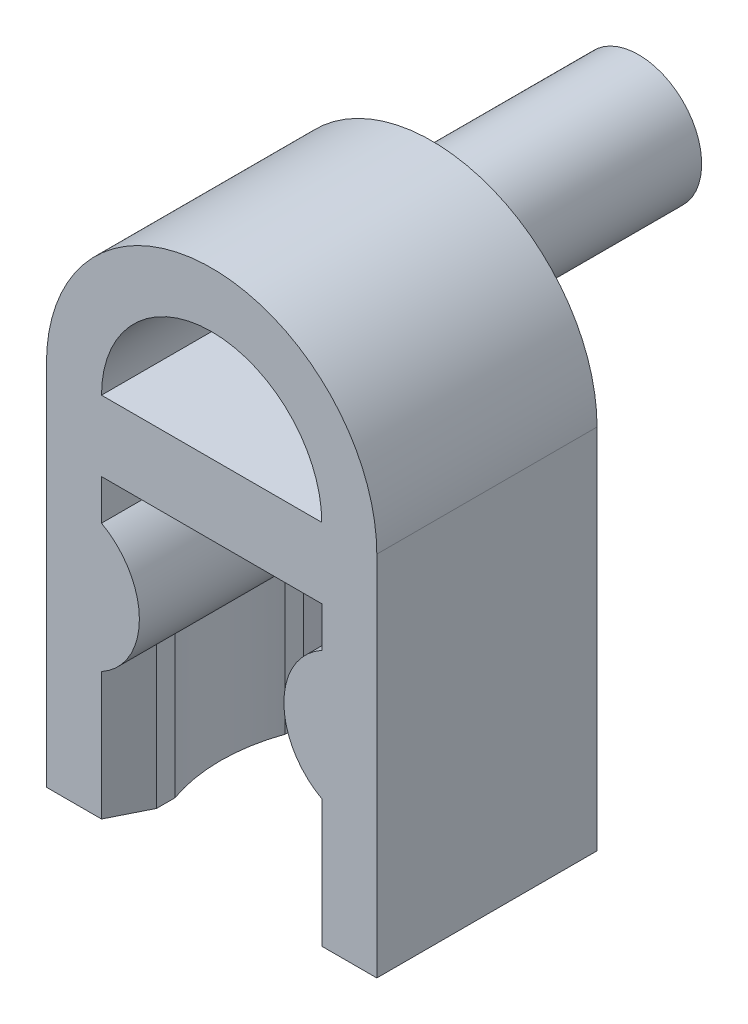
ISO-10303-21;
HEADER;
FILE_DESCRIPTION(('STEP AP214'),'2;1');
FILE_NAME('part.step','',(''),(''),'','','');
FILE_SCHEMA(('AUTOMOTIVE_DESIGN { 1 0 10303 214 1 1 1 1 }'));
ENDSEC;
DATA;
#1=APPLICATION_CONTEXT('core data for automotive mechanical design processes');
#2=APPLICATION_PROTOCOL_DEFINITION('international standard','automotive_design',2000,#1);
#3=PRODUCT_CONTEXT('',#1,'mechanical');
#4=PRODUCT('Part','Part','',(#3));
#5=PRODUCT_RELATED_PRODUCT_CATEGORY('part','',(#4));
#6=PRODUCT_DEFINITION_FORMATION('','',#4);
#7=PRODUCT_DEFINITION_CONTEXT('part definition',#1,'design');
#8=PRODUCT_DEFINITION('design','',#6,#7);
#9=PRODUCT_DEFINITION_SHAPE('','',#8);
#10=(LENGTH_UNIT() NAMED_UNIT(*) SI_UNIT(.MILLI.,.METRE.));
#11=(NAMED_UNIT(*) PLANE_ANGLE_UNIT() SI_UNIT($,.RADIAN.));
#12=(NAMED_UNIT(*) SI_UNIT($,.STERADIAN.) SOLID_ANGLE_UNIT());
#13=UNCERTAINTY_MEASURE_WITH_UNIT(LENGTH_MEASURE(1.E-05),#10,'distance_accuracy_value','');
#14=(GEOMETRIC_REPRESENTATION_CONTEXT(3) GLOBAL_UNCERTAINTY_ASSIGNED_CONTEXT((#13)) GLOBAL_UNIT_ASSIGNED_CONTEXT((#10,
#11,#12)) REPRESENTATION_CONTEXT('',''));
#15=CARTESIAN_POINT('',(0.,0.,0.));
#16=DIRECTION('',(0.,0.,1.));
#17=DIRECTION('',(1.,0.,0.));
#18=AXIS2_PLACEMENT_3D('',#15,#16,#17);
#19=CARTESIAN_POINT('',(-3.96824583655185,-4.77,6.));
#20=DIRECTION('',(0.,0.,-1.));
#21=DIRECTION('',(-1.,0.,0.));
#22=AXIS2_PLACEMENT_3D('',#19,#20,#21);
#23=CYLINDRICAL_SURFACE('',#22,2.);
#24=DIRECTION('',(0.,0.,-1.));
#25=VECTOR('',#24,1.);
#26=CARTESIAN_POINT('',(-2.5,-6.12803319674011,6.));
#27=LINE('',#26,#25);
#28=CARTESIAN_POINT('',(-2.5,-6.12803319674011,1.));
#29=VERTEX_POINT('',#28);
#30=CARTESIAN_POINT('',(-2.5,-6.12803319674011,1.5));
#31=VERTEX_POINT('',#30);
#32=EDGE_CURVE('E199',#29,#31,#27,.F.);
#33=ORIENTED_EDGE('',*,*,#32,.F.);
#34=CARTESIAN_POINT('',(-3.96824583655185,-4.77,-1.93649167310371));
#35=DIRECTION('',(0.894427190999916,0.,-0.447213595499958));
#36=DIRECTION('',(-0.447213595499958,0.,-0.894427190999916));
#37=AXIS2_PLACEMENT_3D('',#34,#35,#36);
#38=ELLIPSE('',#37,4.47213595499958,2.);
#39=CARTESIAN_POINT('',(-3.,-6.51999999968211,0.));
#40=VERTEX_POINT('',#39);
#41=EDGE_CURVE('E197',#40,#29,#38,.F.);
#42=ORIENTED_EDGE('',*,*,#41,.F.);
#43=CARTESIAN_POINT('',(-3.96824583655185,-4.77,0.));
#44=DIRECTION('',(0.,0.,1.));
#45=DIRECTION('',(-1.,0.,0.));
#46=AXIS2_PLACEMENT_3D('',#43,#44,#45);
#47=CIRCLE('',#46,2.);
#48=CARTESIAN_POINT('',(-3.,-3.02,0.));
#49=VERTEX_POINT('',#48);
#50=EDGE_CURVE('E184',#40,#49,#47,.T.);
#51=ORIENTED_EDGE('',*,*,#50,.T.);
#52=DIRECTION('',(0.,0.,-1.));
#53=VECTOR('',#52,1.);
#54=CARTESIAN_POINT('',(-3.,-3.02,6.));
#55=LINE('',#54,#53);
#56=CARTESIAN_POINT('',(-3.,-3.02,6.));
#57=VERTEX_POINT('',#56);
#58=EDGE_CURVE('E11',#57,#49,#55,.T.);
#59=ORIENTED_EDGE('',*,*,#58,.F.);
#60=CARTESIAN_POINT('',(-3.96824583655185,-4.77,6.));
#61=DIRECTION('',(0.,0.,1.));
#62=DIRECTION('',(-1.,0.,0.));
#63=AXIS2_PLACEMENT_3D('',#60,#61,#62);
#64=CIRCLE('',#63,2.);
#65=CARTESIAN_POINT('',(-3.,-6.52,6.));
#66=VERTEX_POINT('',#65);
#67=EDGE_CURVE('E207',#66,#57,#64,.T.);
#68=ORIENTED_EDGE('',*,*,#67,.F.);
#69=CARTESIAN_POINT('',(-3.96824583655185,-4.77,7.93649167310371));
#70=DIRECTION('',(0.894427190999916,0.,0.447213595499958));
#71=DIRECTION('',(0.447213595499958,0.,-0.894427190999916));
#72=AXIS2_PLACEMENT_3D('',#69,#70,#71);
#73=ELLIPSE('',#72,4.47213595499958,2.);
#74=CARTESIAN_POINT('',(-2.5,-6.12803319674011,5.));
#75=VERTEX_POINT('',#74);
#76=EDGE_CURVE('E51',#75,#66,#73,.F.);
#77=ORIENTED_EDGE('',*,*,#76,.F.);
#78=DIRECTION('',(0.,0.,-1.));
#79=VECTOR('',#78,1.);
#80=CARTESIAN_POINT('',(-2.5,-6.12803319674011,6.));
#81=LINE('',#80,#79);
#82=CARTESIAN_POINT('',(-2.5,-6.12803319674782,4.5));
#83=VERTEX_POINT('',#82);
#84=EDGE_CURVE('E55',#83,#75,#81,.F.);
#85=ORIENTED_EDGE('',*,*,#84,.F.);
#86=CARTESIAN_POINT('',(-2.5,-6.12803319674782,1.5));
#87=CARTESIAN_POINT('',(-2.51335384380951,-6.14246691343955,1.53776626442588));
#88=CARTESIAN_POINT('',(-2.52630020378791,-6.15604120585051,1.57599334475921));
#89=CARTESIAN_POINT('',(-2.55129940671943,-6.18158925104955,1.65325418658924));
#90=CARTESIAN_POINT('',(-2.56335248885841,-6.19356343298108,1.69228772854033));
#91=CARTESIAN_POINT('',(-2.59803115870179,-6.22724167132125,1.81034298620861));
#92=CARTESIAN_POINT('',(-2.6192150939947,-6.24674231980654,1.89042880993735));
#93=CARTESIAN_POINT('',(-2.65727731080432,-6.28063176077419,2.05255387403511));
#94=CARTESIAN_POINT('',(-2.67416024643319,-6.2950260854897,2.13459089696433));
#95=CARTESIAN_POINT('',(-2.70339948309578,-6.31936284719166,2.30014632286391));
#96=CARTESIAN_POINT('',(-2.71575407638802,-6.32930360494964,2.38366527227965));
#97=CARTESIAN_POINT('',(-2.73585364732032,-6.34523811040913,2.55237334444175));
#98=CARTESIAN_POINT('',(-2.74355723558507,-6.35119646731376,2.63757069146816));
#99=CARTESIAN_POINT('',(-2.75409729877905,-6.35930403115432,2.80847762889126));
#100=CARTESIAN_POINT('',(-2.75693185554734,-6.3614517368905,2.89418740782425));
#101=CARTESIAN_POINT('',(-2.75769716661006,-6.36203397847896,3.06565220206671));
#102=CARTESIAN_POINT('',(-2.7556273088424,-6.36046805087649,3.15140722168685));
#103=CARTESIAN_POINT('',(-2.74660684798277,-6.35354996179177,3.32247523197276));
#104=CARTESIAN_POINT('',(-2.73965810785353,-6.34819924549542,3.40778837884228));
#105=CARTESIAN_POINT('',(-2.72067871598569,-6.33324267694126,3.58009902817843));
#106=CARTESIAN_POINT('',(-2.7085013826975,-6.32351358307846,3.66706992657042));
#107=CARTESIAN_POINT('',(-2.67922701903464,-6.29931073700253,3.839481604955));
#108=CARTESIAN_POINT('',(-2.66213182985103,-6.2848387601907,3.92492294490436));
#109=CARTESIAN_POINT('',(-2.62327351056184,-6.25044774732333,4.09375348902662));
#110=CARTESIAN_POINT('',(-2.60150539083328,-6.23052288252821,4.17714039259491));
#111=CARTESIAN_POINT('',(-2.56570074808495,-6.19588264236902,4.30000817257131));
#112=CARTESIAN_POINT('',(-2.55322978909883,-6.18353255335001,4.34062532870437));
#113=CARTESIAN_POINT('',(-2.52731963696502,-6.1571091374482,4.4209942509042));
#114=CARTESIAN_POINT('',(-2.51388015900862,-6.14303530281192,4.46074575790099));
#115=CARTESIAN_POINT('',(-2.50000000000022,-6.12803319674034,4.49999999999938));
#116=B_SPLINE_CURVE_WITH_KNOTS('',3,(#86,#87,#88,#89,#90,#91,#92,#93,#94,#95,#96,#97,#98,#99,
#100,#101,#102,#103,#104,#105,#106,#107,#108,#109,#110,#111,#112,#113,#114,#115),.UNSPECIFIED.,
.F.,.F.,(4,2,2,2,2,2,2,2,2,2,2,2,2,2,4),(0.,0.127705392100496,0.255376465070504,
0.510350470775594,0.765047385774155,1.01984025421878,1.27686833283261,1.53399764477134,
1.79115904767463,2.04822230889017,2.31302381578273,2.57772631264491,2.84271286984063,
2.97540777210756,3.10814185595436),.UNSPECIFIED.);
#117=EDGE_CURVE('E475',#31,#83,#116,.T.);
#118=ORIENTED_EDGE('',*,*,#117,.F.);
#119=EDGE_LOOP('',(#33,#42,#51,#59,#68,#77,#85,#118));
#120=FACE_BOUND('',#119,.T.);
#121=ADVANCED_FACE('F37',(#120),#23,.T.);
#122=CARTESIAN_POINT('',(-3.,-3.02,6.));
#123=DIRECTION('',(-1.,0.,0.));
#124=DIRECTION('',(0.,0.,1.));
#125=AXIS2_PLACEMENT_3D('',#122,#123,#124);
#126=PLANE('',#125);
#127=DIRECTION('',(0.,1.,0.));
#128=VECTOR('',#127,1.);
#129=CARTESIAN_POINT('',(-3.,-3.02,0.));
#130=LINE('',#129,#128);
#131=CARTESIAN_POINT('',(-3.,-1.92,0.));
#132=VERTEX_POINT('',#131);
#133=EDGE_CURVE('E192',#49,#132,#130,.T.);
#134=ORIENTED_EDGE('',*,*,#133,.T.);
#135=DIRECTION('',(0.,0.,-1.));
#136=VECTOR('',#135,1.);
#137=CARTESIAN_POINT('',(-3.,-1.92,6.));
#138=LINE('',#137,#136);
#139=CARTESIAN_POINT('',(-3.,-1.92,6.));
#140=VERTEX_POINT('',#139);
#141=EDGE_CURVE('E44',#140,#132,#138,.T.);
#142=ORIENTED_EDGE('',*,*,#141,.F.);
#143=DIRECTION('',(0.,1.,0.));
#144=VECTOR('',#143,1.);
#145=CARTESIAN_POINT('',(-3.,-3.02,6.));
#146=LINE('',#145,#144);
#147=EDGE_CURVE('E211',#57,#140,#146,.T.);
#148=ORIENTED_EDGE('',*,*,#147,.F.);
#149=ORIENTED_EDGE('',*,*,#58,.T.);
#150=EDGE_LOOP('',(#134,#142,#148,#149));
#151=FACE_BOUND('',#150,.T.);
#152=ADVANCED_FACE('F384',(#151),#126,.F.);
#153=CARTESIAN_POINT('',(-3.,-1.92,6.));
#154=DIRECTION('',(0.,1.,0.));
#155=DIRECTION('',(0.,0.,1.));
#156=AXIS2_PLACEMENT_3D('',#153,#154,#155);
#157=PLANE('',#156);
#158=DIRECTION('',(1.,0.,0.));
#159=VECTOR('',#158,1.);
#160=CARTESIAN_POINT('',(-3.,-1.92,0.));
#161=LINE('',#160,#159);
#162=CARTESIAN_POINT('',(3.,-1.92,0.));
#163=VERTEX_POINT('',#162);
#164=EDGE_CURVE('E241',#132,#163,#161,.T.);
#165=ORIENTED_EDGE('',*,*,#164,.T.);
#166=DIRECTION('',(0.,0.,-1.));
#167=VECTOR('',#166,1.);
#168=CARTESIAN_POINT('',(3.,-1.92,6.));
#169=LINE('',#168,#167);
#170=CARTESIAN_POINT('',(3.,-1.92,6.));
#171=VERTEX_POINT('',#170);
#172=EDGE_CURVE('E233',#171,#163,#169,.T.);
#173=ORIENTED_EDGE('',*,*,#172,.F.);
#174=DIRECTION('',(1.,0.,0.));
#175=VECTOR('',#174,1.);
#176=CARTESIAN_POINT('',(-3.,-1.92,6.));
#177=LINE('',#176,#175);
#178=EDGE_CURVE('E242',#140,#171,#177,.T.);
#179=ORIENTED_EDGE('',*,*,#178,.F.);
#180=ORIENTED_EDGE('',*,*,#141,.T.);
#181=EDGE_LOOP('',(#165,#173,#179,#180));
#182=FACE_BOUND('',#181,.T.);
#183=ADVANCED_FACE('F239',(#182),#157,.F.);
#184=CARTESIAN_POINT('',(3.,-1.92,6.));
#185=DIRECTION('',(1.,0.,0.));
#186=DIRECTION('',(0.,0.,-1.));
#187=AXIS2_PLACEMENT_3D('',#184,#185,#186);
#188=PLANE('',#187);
#189=DIRECTION('',(0.,-1.,0.));
#190=VECTOR('',#189,1.);
#191=CARTESIAN_POINT('',(3.,-1.92,0.));
#192=LINE('',#191,#190);
#193=CARTESIAN_POINT('',(3.,-3.02,0.));
#194=VERTEX_POINT('',#193);
#195=EDGE_CURVE('E246',#163,#194,#192,.T.);
#196=ORIENTED_EDGE('',*,*,#195,.T.);
#197=DIRECTION('',(0.,0.,-1.));
#198=VECTOR('',#197,1.);
#199=CARTESIAN_POINT('',(3.,-3.02,6.));
#200=LINE('',#199,#198);
#201=CARTESIAN_POINT('',(3.,-3.02,6.));
#202=VERTEX_POINT('',#201);
#203=EDGE_CURVE('E230',#202,#194,#200,.T.);
#204=ORIENTED_EDGE('',*,*,#203,.F.);
#205=DIRECTION('',(0.,-1.,0.));
#206=VECTOR('',#205,1.);
#207=CARTESIAN_POINT('',(3.,-1.92,6.));
#208=LINE('',#207,#206);
#209=EDGE_CURVE('E294',#171,#202,#208,.T.);
#210=ORIENTED_EDGE('',*,*,#209,.F.);
#211=ORIENTED_EDGE('',*,*,#172,.T.);
#212=EDGE_LOOP('',(#196,#204,#210,#211));
#213=FACE_BOUND('',#212,.T.);
#214=ADVANCED_FACE('F391',(#213),#188,.F.);
#215=CARTESIAN_POINT('',(3.96824583655186,-4.77,6.));
#216=DIRECTION('',(0.,0.,-1.));
#217=DIRECTION('',(-1.,0.,0.));
#218=AXIS2_PLACEMENT_3D('',#215,#216,#217);
#219=CYLINDRICAL_SURFACE('',#218,2.);
#220=CARTESIAN_POINT('',(3.96824583655186,-4.77,0.));
#221=DIRECTION('',(0.,0.,1.));
#222=DIRECTION('',(1.,0.,0.));
#223=AXIS2_PLACEMENT_3D('',#220,#221,#222);
#224=CIRCLE('',#223,2.);
#225=CARTESIAN_POINT('',(3.,-6.52,0.));
#226=VERTEX_POINT('',#225);
#227=EDGE_CURVE('E248',#194,#226,#224,.T.);
#228=ORIENTED_EDGE('',*,*,#227,.T.);
#229=CARTESIAN_POINT('',(3.96824583655186,-4.77,-1.93649167310371));
#230=DIRECTION('',(-0.894427190999916,0.,-0.447213595499958));
#231=DIRECTION('',(0.447213595499958,0.,-0.894427190999916));
#232=AXIS2_PLACEMENT_3D('',#229,#230,#231);
#233=ELLIPSE('',#232,4.47213595499958,2.);
#234=CARTESIAN_POINT('',(2.5,-6.1280331967401,0.999999999999999));
#235=VERTEX_POINT('',#234);
#236=EDGE_CURVE('E325',#235,#226,#233,.F.);
#237=ORIENTED_EDGE('',*,*,#236,.F.);
#238=DIRECTION('',(0.,0.,-1.));
#239=VECTOR('',#238,1.);
#240=CARTESIAN_POINT('',(2.5,-6.1280331967401,6.));
#241=LINE('',#240,#239);
#242=CARTESIAN_POINT('',(2.5,-6.12803319674781,1.5));
#243=VERTEX_POINT('',#242);
#244=EDGE_CURVE('E329',#243,#235,#241,.T.);
#245=ORIENTED_EDGE('',*,*,#244,.F.);
#246=CARTESIAN_POINT('',(2.5,-6.12803319674781,4.5));
#247=CARTESIAN_POINT('',(2.51335384380951,-6.14246691343954,4.46223373557412));
#248=CARTESIAN_POINT('',(2.52630020378791,-6.15604120585051,4.42400665524079));
#249=CARTESIAN_POINT('',(2.55129940671943,-6.18158925104955,4.34674581341076));
#250=CARTESIAN_POINT('',(2.56335248885841,-6.19356343298108,4.30771227145967));
#251=CARTESIAN_POINT('',(2.59803115870179,-6.22724167132125,4.18965701379139));
#252=CARTESIAN_POINT('',(2.6192150939947,-6.24674231980654,4.10957119006265));
#253=CARTESIAN_POINT('',(2.65727731080432,-6.28063176077419,3.94744612596489));
#254=CARTESIAN_POINT('',(2.67416024643319,-6.2950260854897,3.86540910303566));
#255=CARTESIAN_POINT('',(2.70339948309578,-6.31936284719166,3.69985367713609));
#256=CARTESIAN_POINT('',(2.71575407638802,-6.32930360494964,3.61633472772035));
#257=CARTESIAN_POINT('',(2.73585364732032,-6.34523811040913,3.44762665555825));
#258=CARTESIAN_POINT('',(2.74355723558507,-6.35119646731376,3.36242930853184));
#259=CARTESIAN_POINT('',(2.75409729877905,-6.35930403115432,3.19152237110874));
#260=CARTESIAN_POINT('',(2.75693185554734,-6.3614517368905,3.10581259217575));
#261=CARTESIAN_POINT('',(2.75769716661006,-6.36203397847896,2.93434779793329));
#262=CARTESIAN_POINT('',(2.7556273088424,-6.36046805087649,2.84859277831315));
#263=CARTESIAN_POINT('',(2.74660684798277,-6.35354996179176,2.67752476802724));
#264=CARTESIAN_POINT('',(2.73965810785353,-6.34819924549542,2.59221162115772));
#265=CARTESIAN_POINT('',(2.72067871598569,-6.33324267694126,2.41990097182157));
#266=CARTESIAN_POINT('',(2.7085013826975,-6.32351358307846,2.33293007342958));
#267=CARTESIAN_POINT('',(2.67922701903464,-6.29931073700253,2.160518395045));
#268=CARTESIAN_POINT('',(2.66213182985103,-6.2848387601907,2.07507705509564));
#269=CARTESIAN_POINT('',(2.62327351056184,-6.25044774732333,1.90624651097339));
#270=CARTESIAN_POINT('',(2.60150539083328,-6.23052288252821,1.82285960740509));
#271=CARTESIAN_POINT('',(2.56570074808495,-6.19588264236902,1.6999918274287));
#272=CARTESIAN_POINT('',(2.55322978909883,-6.18353255335001,1.65937467129564));
#273=CARTESIAN_POINT('',(2.52731963696502,-6.1571091374482,1.57900574909581));
#274=CARTESIAN_POINT('',(2.51388015900862,-6.14303530281192,1.53925424209901));
#275=CARTESIAN_POINT('',(2.50000000000022,-6.12803319674034,1.50000000000062));
#276=B_SPLINE_CURVE_WITH_KNOTS('',3,(#246,#247,#248,#249,#250,#251,#252,#253,#254,#255,#256,
#257,#258,#259,#260,#261,#262,#263,#264,#265,#266,#267,#268,#269,#270,#271,#272,#273,#274,#275),
.UNSPECIFIED.,.F.,.F.,(4,2,2,2,2,2,2,2,2,2,2,2,2,2,4),(0.,0.127705392100496,0.255376465070504,
0.510350470775595,0.765047385774156,1.01984025421878,1.27686833283261,1.53399764477134,
1.79115904767463,2.04822230889017,2.31302381578273,2.57772631264491,2.84271286984063,
2.97540777210755,3.10814185595436),.UNSPECIFIED.);
#277=CARTESIAN_POINT('',(2.5,-6.1280331967401,4.5));
#278=VERTEX_POINT('',#277);
#279=EDGE_CURVE('E353',#278,#243,#276,.T.);
#280=ORIENTED_EDGE('',*,*,#279,.F.);
#281=DIRECTION('',(0.,0.,-1.));
#282=VECTOR('',#281,1.);
#283=CARTESIAN_POINT('',(2.5,-6.1280331967401,6.));
#284=LINE('',#283,#282);
#285=CARTESIAN_POINT('',(2.499999999976,-6.12803319671416,4.99999999995199));
#286=VERTEX_POINT('',#285);
#287=EDGE_CURVE('E323',#286,#278,#284,.T.);
#288=ORIENTED_EDGE('',*,*,#287,.F.);
#289=CARTESIAN_POINT('',(3.96824583655186,-4.77,7.93649167310371));
#290=DIRECTION('',(-0.894427190999916,0.,0.447213595499958));
#291=DIRECTION('',(-0.447213595499958,0.,-0.894427190999916));
#292=AXIS2_PLACEMENT_3D('',#289,#290,#291);
#293=ELLIPSE('',#292,4.47213595499958,2.);
#294=CARTESIAN_POINT('',(3.,-6.52,6.));
#295=VERTEX_POINT('',#294);
#296=EDGE_CURVE('E320',#295,#286,#293,.F.);
#297=ORIENTED_EDGE('',*,*,#296,.F.);
#298=CARTESIAN_POINT('',(3.96824583655186,-4.77,6.));
#299=DIRECTION('',(0.,0.,1.));
#300=DIRECTION('',(1.,0.,0.));
#301=AXIS2_PLACEMENT_3D('',#298,#299,#300);
#302=CIRCLE('',#301,2.);
#303=EDGE_CURVE('E291',#202,#295,#302,.T.);
#304=ORIENTED_EDGE('',*,*,#303,.F.);
#305=ORIENTED_EDGE('',*,*,#203,.T.);
#306=EDGE_LOOP('',(#228,#237,#245,#280,#288,#297,#304,#305));
#307=FACE_BOUND('',#306,.T.);
#308=ADVANCED_FACE('F396',(#307),#219,.T.);
#309=CARTESIAN_POINT('',(4.5,-10.,6.));
#310=DIRECTION('',(0.,1.,0.));
#311=DIRECTION('',(-1.,0.,0.));
#312=AXIS2_PLACEMENT_3D('',#309,#310,#311);
#313=PLANE('',#312);
#314=DIRECTION('',(1.,0.,0.));
#315=VECTOR('',#314,1.);
#316=CARTESIAN_POINT('',(4.5,-10.,0.));
#317=LINE('',#316,#315);
#318=CARTESIAN_POINT('',(3.,-10.,0.));
#319=VERTEX_POINT('',#318);
#320=CARTESIAN_POINT('',(4.5,-10.,0.));
#321=VERTEX_POINT('',#320);
#322=EDGE_CURVE('E256',#319,#321,#317,.T.);
#323=ORIENTED_EDGE('',*,*,#322,.T.);
#324=DIRECTION('',(0.,0.,-1.));
#325=VECTOR('',#324,1.);
#326=CARTESIAN_POINT('',(4.5,-10.,6.));
#327=LINE('',#326,#325);
#328=CARTESIAN_POINT('',(4.5,-10.,6.));
#329=VERTEX_POINT('',#328);
#330=EDGE_CURVE('E227',#329,#321,#327,.T.);
#331=ORIENTED_EDGE('',*,*,#330,.F.);
#332=DIRECTION('',(1.,0.,0.));
#333=VECTOR('',#332,1.);
#334=CARTESIAN_POINT('',(4.5,-10.,6.));
#335=LINE('',#334,#333);
#336=CARTESIAN_POINT('',(3.,-10.,6.));
#337=VERTEX_POINT('',#336);
#338=EDGE_CURVE('E287',#337,#329,#335,.T.);
#339=ORIENTED_EDGE('',*,*,#338,.F.);
#340=DIRECTION('',(-0.447213595499958,0.,-0.894427190999916));
#341=VECTOR('',#340,1.);
#342=CARTESIAN_POINT('',(2.5,-10.,5.));
#343=LINE('',#342,#341);
#344=CARTESIAN_POINT('',(2.5,-10.,5.));
#345=VERTEX_POINT('',#344);
#346=EDGE_CURVE('E317',#337,#345,#343,.T.);
#347=ORIENTED_EDGE('',*,*,#346,.T.);
#348=DIRECTION('',(0.,0.,-1.));
#349=VECTOR('',#348,1.);
#350=CARTESIAN_POINT('',(2.5,-10.,5.));
#351=LINE('',#350,#349);
#352=CARTESIAN_POINT('',(2.5,-10.,4.5));
#353=VERTEX_POINT('',#352);
#354=EDGE_CURVE('E337',#345,#353,#351,.T.);
#355=ORIENTED_EDGE('',*,*,#354,.T.);
#356=CARTESIAN_POINT('',(-1.74264068711928,-10.,3.));
#357=DIRECTION('',(0.,1.,0.));
#358=DIRECTION('',(0.,0.,1.));
#359=AXIS2_PLACEMENT_3D('',#356,#357,#358);
#360=CIRCLE('',#359,4.5);
#361=CARTESIAN_POINT('',(2.5,-10.,1.5));
#362=VERTEX_POINT('',#361);
#363=EDGE_CURVE('E340',#353,#362,#360,.T.);
#364=ORIENTED_EDGE('',*,*,#363,.T.);
#365=DIRECTION('',(0.,0.,-1.));
#366=VECTOR('',#365,1.);
#367=CARTESIAN_POINT('',(2.5,-10.,0.999999999999999));
#368=LINE('',#367,#366);
#369=CARTESIAN_POINT('',(2.5,-10.,0.999999999999999));
#370=VERTEX_POINT('',#369);
#371=EDGE_CURVE('E343',#362,#370,#368,.T.);
#372=ORIENTED_EDGE('',*,*,#371,.T.);
#373=DIRECTION('',(0.447213595499958,0.,-0.894427190999916));
#374=VECTOR('',#373,1.);
#375=CARTESIAN_POINT('',(2.5,-10.,0.999999999999999));
#376=LINE('',#375,#374);
#377=EDGE_CURVE('E344',#370,#319,#376,.T.);
#378=ORIENTED_EDGE('',*,*,#377,.T.);
#379=EDGE_LOOP('',(#323,#331,#339,#347,#355,#364,#372,#378));
#380=FACE_BOUND('',#379,.T.);
#381=ADVANCED_FACE('F400',(#380),#313,.F.);
#382=CARTESIAN_POINT('',(4.5,0.,6.));
#383=DIRECTION('',(-1.,0.,0.));
#384=DIRECTION('',(0.,-1.,0.));
#385=AXIS2_PLACEMENT_3D('',#382,#383,#384);
#386=PLANE('',#385);
#387=DIRECTION('',(0.,1.,0.));
#388=VECTOR('',#387,1.);
#389=CARTESIAN_POINT('',(4.5,0.,0.));
#390=LINE('',#389,#388);
#391=CARTESIAN_POINT('',(4.5,0.,0.));
#392=VERTEX_POINT('',#391);
#393=EDGE_CURVE('E258',#321,#392,#390,.T.);
#394=ORIENTED_EDGE('',*,*,#393,.T.);
#395=DIRECTION('',(0.,0.,-1.));
#396=VECTOR('',#395,1.);
#397=CARTESIAN_POINT('',(4.5,0.,6.));
#398=LINE('',#397,#396);
#399=CARTESIAN_POINT('',(4.5,0.,6.));
#400=VERTEX_POINT('',#399);
#401=EDGE_CURVE('E224',#400,#392,#398,.T.);
#402=ORIENTED_EDGE('',*,*,#401,.F.);
#403=DIRECTION('',(0.,1.,0.));
#404=VECTOR('',#403,1.);
#405=CARTESIAN_POINT('',(4.5,0.,6.));
#406=LINE('',#405,#404);
#407=EDGE_CURVE('E285',#329,#400,#406,.T.);
#408=ORIENTED_EDGE('',*,*,#407,.F.);
#409=ORIENTED_EDGE('',*,*,#330,.T.);
#410=EDGE_LOOP('',(#394,#402,#408,#409));
#411=FACE_BOUND('',#410,.T.);
#412=ADVANCED_FACE('F404',(#411),#386,.F.);
#413=CARTESIAN_POINT('',(0.,0.,6.));
#414=DIRECTION('',(0.,0.,-1.));
#415=DIRECTION('',(-1.,0.,0.));
#416=AXIS2_PLACEMENT_3D('',#413,#414,#415);
#417=CYLINDRICAL_SURFACE('',#416,4.5);
#418=CARTESIAN_POINT('',(0.,0.,0.));
#419=DIRECTION('',(0.,0.,1.));
#420=DIRECTION('',(1.,0.,0.));
#421=AXIS2_PLACEMENT_3D('',#418,#419,#420);
#422=CIRCLE('',#421,4.5);
#423=CARTESIAN_POINT('',(-4.5,0.,0.));
#424=VERTEX_POINT('',#423);
#425=EDGE_CURVE('E260',#392,#424,#422,.T.);
#426=ORIENTED_EDGE('',*,*,#425,.T.);
#427=DIRECTION('',(0.,0.,-1.));
#428=VECTOR('',#427,1.);
#429=CARTESIAN_POINT('',(-4.5,0.,6.));
#430=LINE('',#429,#428);
#431=CARTESIAN_POINT('',(-4.5,0.,6.));
#432=VERTEX_POINT('',#431);
#433=EDGE_CURVE('E220',#432,#424,#430,.T.);
#434=ORIENTED_EDGE('',*,*,#433,.F.);
#435=CARTESIAN_POINT('',(0.,0.,6.));
#436=DIRECTION('',(0.,0.,1.));
#437=DIRECTION('',(1.,0.,0.));
#438=AXIS2_PLACEMENT_3D('',#435,#436,#437);
#439=CIRCLE('',#438,4.5);
#440=EDGE_CURVE('E281',#400,#432,#439,.T.);
#441=ORIENTED_EDGE('',*,*,#440,.F.);
#442=ORIENTED_EDGE('',*,*,#401,.T.);
#443=EDGE_LOOP('',(#426,#434,#441,#442));
#444=FACE_BOUND('',#443,.T.);
#445=ADVANCED_FACE('F408',(#444),#417,.T.);
#446=CARTESIAN_POINT('',(-4.5,0.,6.));
#447=DIRECTION('',(1.,0.,0.));
#448=DIRECTION('',(0.,1.,0.));
#449=AXIS2_PLACEMENT_3D('',#446,#447,#448);
#450=PLANE('',#449);
#451=DIRECTION('',(0.,-1.,0.));
#452=VECTOR('',#451,1.);
#453=CARTESIAN_POINT('',(-4.5,0.,0.));
#454=LINE('',#453,#452);
#455=CARTESIAN_POINT('',(-4.5,-10.,0.));
#456=VERTEX_POINT('',#455);
#457=EDGE_CURVE('E213',#424,#456,#454,.T.);
#458=ORIENTED_EDGE('',*,*,#457,.T.);
#459=DIRECTION('',(0.,0.,-1.));
#460=VECTOR('',#459,1.);
#461=CARTESIAN_POINT('',(-4.5,-10.,6.));
#462=LINE('',#461,#460);
#463=CARTESIAN_POINT('',(-4.5,-10.,6.));
#464=VERTEX_POINT('',#463);
#465=EDGE_CURVE('E217',#464,#456,#462,.T.);
#466=ORIENTED_EDGE('',*,*,#465,.F.);
#467=DIRECTION('',(0.,-1.,0.));
#468=VECTOR('',#467,1.);
#469=CARTESIAN_POINT('',(-4.5,0.,6.));
#470=LINE('',#469,#468);
#471=EDGE_CURVE('E278',#432,#464,#470,.T.);
#472=ORIENTED_EDGE('',*,*,#471,.F.);
#473=ORIENTED_EDGE('',*,*,#433,.T.);
#474=EDGE_LOOP('',(#458,#466,#472,#473));
#475=FACE_BOUND('',#474,.T.);
#476=ADVANCED_FACE('F264',(#475),#450,.F.);
#477=CARTESIAN_POINT('',(-4.5,-10.,6.));
#478=DIRECTION('',(0.,1.,0.));
#479=DIRECTION('',(0.,0.,1.));
#480=AXIS2_PLACEMENT_3D('',#477,#478,#479);
#481=PLANE('',#480);
#482=DIRECTION('',(1.,0.,0.));
#483=VECTOR('',#482,1.);
#484=CARTESIAN_POINT('',(-4.5,-10.,0.));
#485=LINE('',#484,#483);
#486=CARTESIAN_POINT('',(-3.,-10.,0.));
#487=VERTEX_POINT('',#486);
#488=EDGE_CURVE('E208',#456,#487,#485,.T.);
#489=ORIENTED_EDGE('',*,*,#488,.T.);
#490=DIRECTION('',(0.447213595499958,0.,0.894427190999916));
#491=VECTOR('',#490,1.);
#492=CARTESIAN_POINT('',(-2.5,-10.,1.));
#493=LINE('',#492,#491);
#494=CARTESIAN_POINT('',(-2.5,-10.,1.));
#495=VERTEX_POINT('',#494);
#496=EDGE_CURVE('E206',#487,#495,#493,.T.);
#497=ORIENTED_EDGE('',*,*,#496,.T.);
#498=DIRECTION('',(0.,0.,1.));
#499=VECTOR('',#498,1.);
#500=CARTESIAN_POINT('',(-2.5,-10.,1.));
#501=LINE('',#500,#499);
#502=CARTESIAN_POINT('',(-2.5,-10.,1.5));
#503=VERTEX_POINT('',#502);
#504=EDGE_CURVE('E324',#495,#503,#501,.T.);
#505=ORIENTED_EDGE('',*,*,#504,.T.);
#506=CARTESIAN_POINT('',(1.74264068711928,-10.,3.));
#507=DIRECTION('',(0.,1.,0.));
#508=DIRECTION('',(0.,0.,-1.));
#509=AXIS2_PLACEMENT_3D('',#506,#507,#508);
#510=CIRCLE('',#509,4.5);
#511=CARTESIAN_POINT('',(-2.5,-10.,4.5));
#512=VERTEX_POINT('',#511);
#513=EDGE_CURVE('E515',#503,#512,#510,.T.);
#514=ORIENTED_EDGE('',*,*,#513,.T.);
#515=DIRECTION('',(0.,0.,1.));
#516=VECTOR('',#515,1.);
#517=CARTESIAN_POINT('',(-2.5,-10.,5.));
#518=LINE('',#517,#516);
#519=CARTESIAN_POINT('',(-2.5,-10.,5.));
#520=VERTEX_POINT('',#519);
#521=EDGE_CURVE('E504',#512,#520,#518,.T.);
#522=ORIENTED_EDGE('',*,*,#521,.T.);
#523=DIRECTION('',(-0.447213595499958,0.,0.894427190999916));
#524=VECTOR('',#523,1.);
#525=CARTESIAN_POINT('',(-2.5,-10.,5.));
#526=LINE('',#525,#524);
#527=CARTESIAN_POINT('',(-3.,-10.,6.));
#528=VERTEX_POINT('',#527);
#529=EDGE_CURVE('E275',#520,#528,#526,.T.);
#530=ORIENTED_EDGE('',*,*,#529,.T.);
#531=DIRECTION('',(1.,0.,0.));
#532=VECTOR('',#531,1.);
#533=CARTESIAN_POINT('',(-4.5,-10.,6.));
#534=LINE('',#533,#532);
#535=EDGE_CURVE('E272',#464,#528,#534,.T.);
#536=ORIENTED_EDGE('',*,*,#535,.F.);
#537=ORIENTED_EDGE('',*,*,#465,.T.);
#538=EDGE_LOOP('',(#489,#497,#505,#514,#522,#530,#536,#537));
#539=FACE_BOUND('',#538,.T.);
#540=ADVANCED_FACE('F270',(#539),#481,.F.);
#541=CARTESIAN_POINT('',(-3.96824583655185,-4.77,6.));
#542=DIRECTION('',(0.,0.,-1.));
#543=DIRECTION('',(-1.,0.,0.));
#544=AXIS2_PLACEMENT_3D('',#541,#542,#543);
#545=PLANE('',#544);
#546=DIRECTION('',(1.,0.,0.));
#547=VECTOR('',#546,1.);
#548=CARTESIAN_POINT('',(3.,0.,6.));
#549=LINE('',#548,#547);
#550=CARTESIAN_POINT('',(-3.,0.,6.));
#551=VERTEX_POINT('',#550);
#552=CARTESIAN_POINT('',(3.,0.,6.));
#553=VERTEX_POINT('',#552);
#554=EDGE_CURVE('E303',#551,#553,#549,.T.);
#555=ORIENTED_EDGE('',*,*,#554,.F.);
#556=CARTESIAN_POINT('',(0.,0.,6.));
#557=DIRECTION('',(0.,0.,1.));
#558=DIRECTION('',(1.,0.,0.));
#559=AXIS2_PLACEMENT_3D('',#556,#557,#558);
#560=CIRCLE('',#559,3.);
#561=EDGE_CURVE('E307',#553,#551,#560,.T.);
#562=ORIENTED_EDGE('',*,*,#561,.F.);
#563=EDGE_LOOP('',(#555,#562));
#564=FACE_BOUND('',#563,.T.);
#565=ORIENTED_EDGE('',*,*,#67,.T.);
#566=ORIENTED_EDGE('',*,*,#147,.T.);
#567=ORIENTED_EDGE('',*,*,#178,.T.);
#568=ORIENTED_EDGE('',*,*,#209,.T.);
#569=ORIENTED_EDGE('',*,*,#303,.T.);
#570=DIRECTION('',(0.,-1.,0.));
#571=VECTOR('',#570,1.);
#572=CARTESIAN_POINT('',(3.,-10.,6.));
#573=LINE('',#572,#571);
#574=EDGE_CURVE('E289',#295,#337,#573,.T.);
#575=ORIENTED_EDGE('',*,*,#574,.T.);
#576=ORIENTED_EDGE('',*,*,#338,.T.);
#577=ORIENTED_EDGE('',*,*,#407,.T.);
#578=ORIENTED_EDGE('',*,*,#440,.T.);
#579=ORIENTED_EDGE('',*,*,#471,.T.);
#580=ORIENTED_EDGE('',*,*,#535,.T.);
#581=DIRECTION('',(0.,1.,0.));
#582=VECTOR('',#581,1.);
#583=CARTESIAN_POINT('',(-3.,-10.,6.));
#584=LINE('',#583,#582);
#585=EDGE_CURVE('E221',#528,#66,#584,.T.);
#586=ORIENTED_EDGE('',*,*,#585,.T.);
#587=EDGE_LOOP('',(#565,#566,#567,#568,#569,#575,#576,#577,#578,#579,#580,#586));
#588=FACE_BOUND('',#587,.T.);
#589=ADVANCED_FACE('F417',(#564,#588),#545,.F.);
#590=CARTESIAN_POINT('',(-3.96824583655185,-4.77,0.));
#591=DIRECTION('',(0.,0.,-1.));
#592=DIRECTION('',(-1.,0.,0.));
#593=AXIS2_PLACEMENT_3D('',#590,#591,#592);
#594=PLANE('',#593);
#595=CARTESIAN_POINT('',(0.,2.,0.));
#596=DIRECTION('',(0.,0.,-1.));
#597=DIRECTION('',(-1.,0.,0.));
#598=AXIS2_PLACEMENT_3D('',#595,#596,#597);
#599=CIRCLE('',#598,1.72);
#600=CARTESIAN_POINT('',(-1.72,2.,0.));
#601=VERTEX_POINT('',#600);
#602=EDGE_CURVE('E314',#601,#601,#599,.T.);
#603=ORIENTED_EDGE('',*,*,#602,.F.);
#604=EDGE_LOOP('',(#603));
#605=FACE_BOUND('',#604,.T.);
#606=ORIENTED_EDGE('',*,*,#50,.F.);
#607=DIRECTION('',(0.,1.,0.));
#608=VECTOR('',#607,1.);
#609=CARTESIAN_POINT('',(-3.,-10.,0.));
#610=LINE('',#609,#608);
#611=EDGE_CURVE('E189',#487,#40,#610,.T.);
#612=ORIENTED_EDGE('',*,*,#611,.F.);
#613=ORIENTED_EDGE('',*,*,#488,.F.);
#614=ORIENTED_EDGE('',*,*,#457,.F.);
#615=ORIENTED_EDGE('',*,*,#425,.F.);
#616=ORIENTED_EDGE('',*,*,#393,.F.);
#617=ORIENTED_EDGE('',*,*,#322,.F.);
#618=DIRECTION('',(0.,-1.,0.));
#619=VECTOR('',#618,1.);
#620=CARTESIAN_POINT('',(3.,-10.,0.));
#621=LINE('',#620,#619);
#622=EDGE_CURVE('E253',#226,#319,#621,.T.);
#623=ORIENTED_EDGE('',*,*,#622,.F.);
#624=ORIENTED_EDGE('',*,*,#227,.F.);
#625=ORIENTED_EDGE('',*,*,#195,.F.);
#626=ORIENTED_EDGE('',*,*,#164,.F.);
#627=ORIENTED_EDGE('',*,*,#133,.F.);
#628=EDGE_LOOP('',(#606,#612,#613,#614,#615,#616,#617,#623,#624,#625,#626,#627));
#629=FACE_BOUND('',#628,.T.);
#630=ADVANCED_FACE('F186',(#605,#629),#594,.T.);
#631=CARTESIAN_POINT('',(0.,0.,2.));
#632=DIRECTION('',(0.,0.,1.));
#633=DIRECTION('',(1.,0.,0.));
#634=AXIS2_PLACEMENT_3D('',#631,#632,#633);
#635=CYLINDRICAL_SURFACE('',#634,3.);
#636=ORIENTED_EDGE('',*,*,#561,.T.);
#637=DIRECTION('',(0.,0.,1.));
#638=VECTOR('',#637,1.);
#639=CARTESIAN_POINT('',(-3.,0.,2.));
#640=LINE('',#639,#638);
#641=CARTESIAN_POINT('',(-3.,0.,2.));
#642=VERTEX_POINT('',#641);
#643=EDGE_CURVE('E298',#642,#551,#640,.T.);
#644=ORIENTED_EDGE('',*,*,#643,.F.);
#645=CARTESIAN_POINT('',(0.,0.,2.));
#646=DIRECTION('',(0.,0.,1.));
#647=DIRECTION('',(1.,0.,0.));
#648=AXIS2_PLACEMENT_3D('',#645,#646,#647);
#649=CIRCLE('',#648,3.);
#650=CARTESIAN_POINT('',(3.,0.,2.));
#651=VERTEX_POINT('',#650);
#652=EDGE_CURVE('E306',#651,#642,#649,.T.);
#653=ORIENTED_EDGE('',*,*,#652,.F.);
#654=DIRECTION('',(0.,0.,1.));
#655=VECTOR('',#654,1.);
#656=CARTESIAN_POINT('',(3.,0.,2.));
#657=LINE('',#656,#655);
#658=EDGE_CURVE('E194',#651,#553,#657,.T.);
#659=ORIENTED_EDGE('',*,*,#658,.T.);
#660=EDGE_LOOP('',(#636,#644,#653,#659));
#661=FACE_BOUND('',#660,.T.);
#662=ADVANCED_FACE('F420',(#661),#635,.F.);
#663=CARTESIAN_POINT('',(3.,0.,2.));
#664=DIRECTION('',(0.,-1.,0.));
#665=DIRECTION('',(0.,0.,-1.));
#666=AXIS2_PLACEMENT_3D('',#663,#664,#665);
#667=PLANE('',#666);
#668=ORIENTED_EDGE('',*,*,#554,.T.);
#669=ORIENTED_EDGE('',*,*,#658,.F.);
#670=DIRECTION('',(1.,0.,0.));
#671=VECTOR('',#670,1.);
#672=CARTESIAN_POINT('',(3.,0.,2.));
#673=LINE('',#672,#671);
#674=EDGE_CURVE('E301',#642,#651,#673,.T.);
#675=ORIENTED_EDGE('',*,*,#674,.F.);
#676=ORIENTED_EDGE('',*,*,#643,.T.);
#677=EDGE_LOOP('',(#668,#669,#675,#676));
#678=FACE_BOUND('',#677,.T.);
#679=ADVANCED_FACE('F427',(#678),#667,.F.);
#680=CARTESIAN_POINT('',(0.,0.,2.));
#681=DIRECTION('',(0.,0.,1.));
#682=DIRECTION('',(1.,0.,0.));
#683=AXIS2_PLACEMENT_3D('',#680,#681,#682);
#684=PLANE('',#683);
#685=ORIENTED_EDGE('',*,*,#652,.T.);
#686=ORIENTED_EDGE('',*,*,#674,.T.);
#687=EDGE_LOOP('',(#685,#686));
#688=FACE_BOUND('',#687,.T.);
#689=ADVANCED_FACE('F431',(#688),#684,.T.);
#690=CARTESIAN_POINT('',(0.,2.,-5.63));
#691=DIRECTION('',(0.,0.,1.));
#692=DIRECTION('',(1.,0.,0.));
#693=AXIS2_PLACEMENT_3D('',#690,#691,#692);
#694=CYLINDRICAL_SURFACE('',#693,1.72);
#695=CARTESIAN_POINT('',(0.,2.,-5.63));
#696=DIRECTION('',(0.,0.,-1.));
#697=DIRECTION('',(-1.,0.,0.));
#698=AXIS2_PLACEMENT_3D('',#695,#696,#697);
#699=CIRCLE('',#698,1.72);
#700=CARTESIAN_POINT('',(-1.72,2.,-5.63));
#701=VERTEX_POINT('',#700);
#702=EDGE_CURVE('E309',#701,#701,#699,.T.);
#703=ORIENTED_EDGE('',*,*,#702,.F.);
#704=EDGE_LOOP('',(#703));
#705=FACE_BOUND('',#704,.T.);
#706=ORIENTED_EDGE('',*,*,#602,.T.);
#707=EDGE_LOOP('',(#706));
#708=FACE_BOUND('',#707,.T.);
#709=ADVANCED_FACE('F435',(#705,#708),#694,.T.);
#710=CARTESIAN_POINT('',(0.,2.,-5.63));
#711=DIRECTION('',(0.,0.,-1.));
#712=DIRECTION('',(-1.,0.,0.));
#713=AXIS2_PLACEMENT_3D('',#710,#711,#712);
#714=PLANE('',#713);
#715=ORIENTED_EDGE('',*,*,#702,.T.);
#716=EDGE_LOOP('',(#715));
#717=FACE_BOUND('',#716,.T.);
#718=ADVANCED_FACE('F373',(#717),#714,.T.);
#719=CARTESIAN_POINT('',(2.5,500000.,0.999999999999999));
#720=DIRECTION('',(-0.894427190999916,0.,-0.447213595499958));
#721=DIRECTION('',(-0.447213595499958,0.,0.894427190999916));
#722=AXIS2_PLACEMENT_3D('',#719,#720,#721);
#723=PLANE('',#722);
#724=DIRECTION('',(0.,-1.,0.));
#725=VECTOR('',#724,1.);
#726=CARTESIAN_POINT('',(2.5,500000.,0.999999999999999));
#727=LINE('',#726,#725);
#728=EDGE_CURVE('E335',#235,#370,#727,.T.);
#729=ORIENTED_EDGE('',*,*,#728,.F.);
#730=ORIENTED_EDGE('',*,*,#236,.T.);
#731=ORIENTED_EDGE('',*,*,#622,.T.);
#732=ORIENTED_EDGE('',*,*,#377,.F.);
#733=EDGE_LOOP('',(#729,#730,#731,#732));
#734=FACE_BOUND('',#733,.T.);
#735=ADVANCED_FACE('F370',(#734),#723,.T.);
#736=CARTESIAN_POINT('',(2.5,500000.,0.999999999999999));
#737=DIRECTION('',(-1.,0.,0.));
#738=DIRECTION('',(0.,0.,1.));
#739=AXIS2_PLACEMENT_3D('',#736,#737,#738);
#740=PLANE('',#739);
#741=DIRECTION('',(0.,-1.,0.));
#742=VECTOR('',#741,1.);
#743=CARTESIAN_POINT('',(2.5,500000.,1.5));
#744=LINE('',#743,#742);
#745=EDGE_CURVE('E333',#243,#362,#744,.T.);
#746=ORIENTED_EDGE('',*,*,#745,.F.);
#747=ORIENTED_EDGE('',*,*,#244,.T.);
#748=ORIENTED_EDGE('',*,*,#728,.T.);
#749=ORIENTED_EDGE('',*,*,#371,.F.);
#750=EDGE_LOOP('',(#746,#747,#748,#749));
#751=FACE_BOUND('',#750,.T.);
#752=ADVANCED_FACE('F372',(#751),#740,.T.);
#753=CARTESIAN_POINT('',(-1.74264068711928,500000.,3.));
#754=DIRECTION('',(0.,-1.,0.));
#755=DIRECTION('',(0.,0.,-1.));
#756=AXIS2_PLACEMENT_3D('',#753,#754,#755);
#757=CYLINDRICAL_SURFACE('',#756,4.5);
#758=DIRECTION('',(0.,-1.,0.));
#759=VECTOR('',#758,1.);
#760=CARTESIAN_POINT('',(2.5,500000.,4.5));
#761=LINE('',#760,#759);
#762=EDGE_CURVE('E331',#278,#353,#761,.T.);
#763=ORIENTED_EDGE('',*,*,#762,.F.);
#764=ORIENTED_EDGE('',*,*,#279,.T.);
#765=ORIENTED_EDGE('',*,*,#745,.T.);
#766=ORIENTED_EDGE('',*,*,#363,.F.);
#767=EDGE_LOOP('',(#763,#764,#765,#766));
#768=FACE_BOUND('',#767,.T.);
#769=ADVANCED_FACE('F361',(#768),#757,.F.);
#770=CARTESIAN_POINT('',(2.5,500000.,5.));
#771=DIRECTION('',(-1.,0.,0.));
#772=DIRECTION('',(0.,0.,1.));
#773=AXIS2_PLACEMENT_3D('',#770,#771,#772);
#774=PLANE('',#773);
#775=DIRECTION('',(0.,-1.,0.));
#776=VECTOR('',#775,1.);
#777=CARTESIAN_POINT('',(2.5,500000.,5.));
#778=LINE('',#777,#776);
#779=EDGE_CURVE('E328',#286,#345,#778,.T.);
#780=ORIENTED_EDGE('',*,*,#779,.F.);
#781=ORIENTED_EDGE('',*,*,#287,.T.);
#782=ORIENTED_EDGE('',*,*,#762,.T.);
#783=ORIENTED_EDGE('',*,*,#354,.F.);
#784=EDGE_LOOP('',(#780,#781,#782,#783));
#785=FACE_BOUND('',#784,.T.);
#786=ADVANCED_FACE('F380',(#785),#774,.T.);
#787=CARTESIAN_POINT('',(2.5,500000.,5.));
#788=DIRECTION('',(-0.894427190999916,0.,0.447213595499958));
#789=DIRECTION('',(0.447213595499958,0.,0.894427190999916));
#790=AXIS2_PLACEMENT_3D('',#787,#788,#789);
#791=PLANE('',#790);
#792=ORIENTED_EDGE('',*,*,#574,.F.);
#793=ORIENTED_EDGE('',*,*,#296,.T.);
#794=ORIENTED_EDGE('',*,*,#779,.T.);
#795=ORIENTED_EDGE('',*,*,#346,.F.);
#796=EDGE_LOOP('',(#792,#793,#794,#795));
#797=FACE_BOUND('',#796,.T.);
#798=ADVANCED_FACE('F443',(#797),#791,.T.);
#799=CARTESIAN_POINT('',(-2.5,500000.,1.));
#800=DIRECTION('',(0.894427190999916,0.,-0.447213595499958));
#801=DIRECTION('',(-0.447213595499958,0.,-0.894427190999916));
#802=AXIS2_PLACEMENT_3D('',#799,#800,#801);
#803=PLANE('',#802);
#804=ORIENTED_EDGE('',*,*,#611,.T.);
#805=ORIENTED_EDGE('',*,*,#41,.T.);
#806=DIRECTION('',(0.,-1.,0.));
#807=VECTOR('',#806,1.);
#808=CARTESIAN_POINT('',(-2.5,500000.,1.));
#809=LINE('',#808,#807);
#810=EDGE_CURVE('E508',#29,#495,#809,.T.);
#811=ORIENTED_EDGE('',*,*,#810,.T.);
#812=ORIENTED_EDGE('',*,*,#496,.F.);
#813=EDGE_LOOP('',(#804,#805,#811,#812));
#814=FACE_BOUND('',#813,.T.);
#815=ADVANCED_FACE('F204',(#814),#803,.T.);
#816=CARTESIAN_POINT('',(-2.5,500000.,5.));
#817=DIRECTION('',(0.894427190999916,0.,0.447213595499958));
#818=DIRECTION('',(0.447213595499958,0.,-0.894427190999916));
#819=AXIS2_PLACEMENT_3D('',#816,#817,#818);
#820=PLANE('',#819);
#821=DIRECTION('',(0.,-1.,0.));
#822=VECTOR('',#821,1.);
#823=CARTESIAN_POINT('',(-2.5,500000.,5.));
#824=LINE('',#823,#822);
#825=EDGE_CURVE('E473',#75,#520,#824,.T.);
#826=ORIENTED_EDGE('',*,*,#825,.F.);
#827=ORIENTED_EDGE('',*,*,#76,.T.);
#828=ORIENTED_EDGE('',*,*,#585,.F.);
#829=ORIENTED_EDGE('',*,*,#529,.F.);
#830=EDGE_LOOP('',(#826,#827,#828,#829));
#831=FACE_BOUND('',#830,.T.);
#832=ADVANCED_FACE('F472',(#831),#820,.T.);
#833=CARTESIAN_POINT('',(-2.5,500000.,5.));
#834=DIRECTION('',(1.,0.,0.));
#835=DIRECTION('',(0.,0.,-1.));
#836=AXIS2_PLACEMENT_3D('',#833,#834,#835);
#837=PLANE('',#836);
#838=DIRECTION('',(0.,-1.,0.));
#839=VECTOR('',#838,1.);
#840=CARTESIAN_POINT('',(-2.5,500000.,4.5));
#841=LINE('',#840,#839);
#842=EDGE_CURVE('E503',#83,#512,#841,.T.);
#843=ORIENTED_EDGE('',*,*,#842,.F.);
#844=ORIENTED_EDGE('',*,*,#84,.T.);
#845=ORIENTED_EDGE('',*,*,#825,.T.);
#846=ORIENTED_EDGE('',*,*,#521,.F.);
#847=EDGE_LOOP('',(#843,#844,#845,#846));
#848=FACE_BOUND('',#847,.T.);
#849=ADVANCED_FACE('F494',(#848),#837,.T.);
#850=CARTESIAN_POINT('',(1.74264068711928,500000.,3.));
#851=DIRECTION('',(0.,-1.,0.));
#852=DIRECTION('',(0.,0.,-1.));
#853=AXIS2_PLACEMENT_3D('',#850,#851,#852);
#854=CYLINDRICAL_SURFACE('',#853,4.5);
#855=DIRECTION('',(0.,-1.,0.));
#856=VECTOR('',#855,1.);
#857=CARTESIAN_POINT('',(-2.5,500000.,1.5));
#858=LINE('',#857,#856);
#859=EDGE_CURVE('E202',#31,#503,#858,.T.);
#860=ORIENTED_EDGE('',*,*,#859,.F.);
#861=ORIENTED_EDGE('',*,*,#117,.T.);
#862=ORIENTED_EDGE('',*,*,#842,.T.);
#863=ORIENTED_EDGE('',*,*,#513,.F.);
#864=EDGE_LOOP('',(#860,#861,#862,#863));
#865=FACE_BOUND('',#864,.T.);
#866=ADVANCED_FACE('F486',(#865),#854,.F.);
#867=CARTESIAN_POINT('',(-2.5,500000.,1.));
#868=DIRECTION('',(1.,0.,0.));
#869=DIRECTION('',(0.,0.,-1.));
#870=AXIS2_PLACEMENT_3D('',#867,#868,#869);
#871=PLANE('',#870);
#872=ORIENTED_EDGE('',*,*,#810,.F.);
#873=ORIENTED_EDGE('',*,*,#32,.T.);
#874=ORIENTED_EDGE('',*,*,#859,.T.);
#875=ORIENTED_EDGE('',*,*,#504,.F.);
#876=EDGE_LOOP('',(#872,#873,#874,#875));
#877=FACE_BOUND('',#876,.T.);
#878=ADVANCED_FACE('F368',(#877),#871,.T.);
#879=CLOSED_SHELL('',(#121,#152,#183,#214,#308,#381,#412,#445,#476,#540,#589,#630,#662,#679,
#689,#709,#718,#735,#752,#769,#786,#798,#815,#832,#849,#866,#878));
#880=MANIFOLD_SOLID_BREP('B2',#879);
#881=ADVANCED_BREP_SHAPE_REPRESENTATION('',(#18,#880),#14);
#882=SHAPE_DEFINITION_REPRESENTATION(#9,#881);
ENDSEC;
END-ISO-10303-21;
